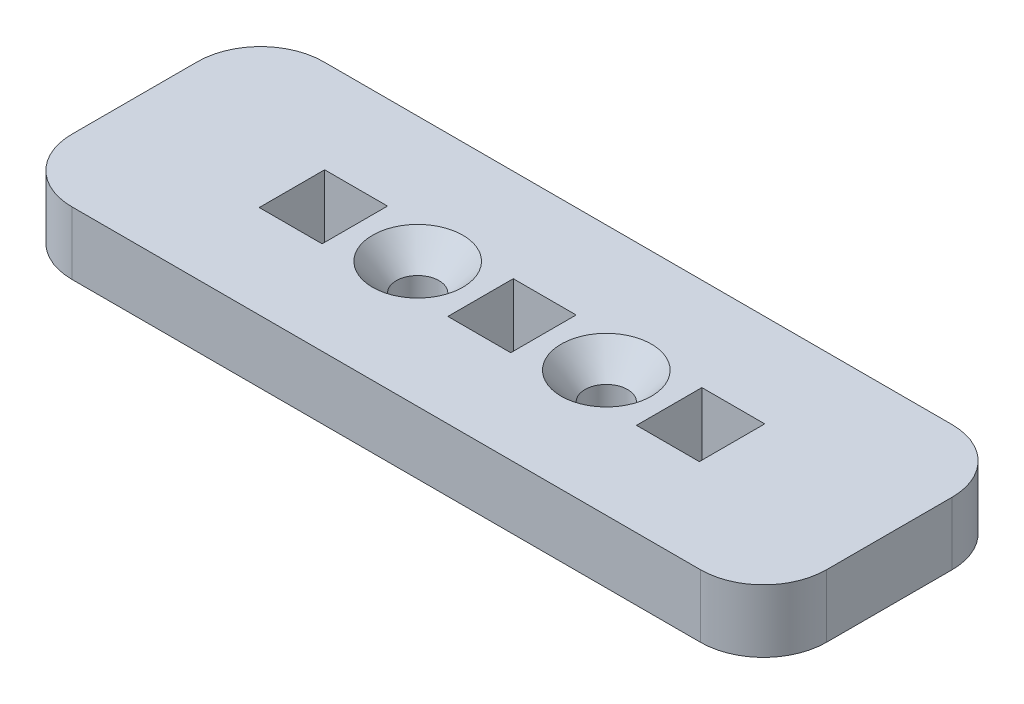
ISO-10303-21;
HEADER;
FILE_DESCRIPTION(('STEP AP214'),'2;1');
FILE_NAME('part.step','',(''),(''),'','','');
FILE_SCHEMA(('AUTOMOTIVE_DESIGN { 1 0 10303 214 1 1 1 1 }'));
ENDSEC;
DATA;
#1=APPLICATION_CONTEXT('core data for automotive mechanical design processes');
#2=APPLICATION_PROTOCOL_DEFINITION('international standard','automotive_design',2000,#1);
#3=PRODUCT_CONTEXT('',#1,'mechanical');
#4=PRODUCT('Part','Part','',(#3));
#5=PRODUCT_RELATED_PRODUCT_CATEGORY('part','',(#4));
#6=PRODUCT_DEFINITION_FORMATION('','',#4);
#7=PRODUCT_DEFINITION_CONTEXT('part definition',#1,'design');
#8=PRODUCT_DEFINITION('design','',#6,#7);
#9=PRODUCT_DEFINITION_SHAPE('','',#8);
#10=(LENGTH_UNIT() NAMED_UNIT(*) SI_UNIT(.MILLI.,.METRE.));
#11=(NAMED_UNIT(*) PLANE_ANGLE_UNIT() SI_UNIT($,.RADIAN.));
#12=(NAMED_UNIT(*) SI_UNIT($,.STERADIAN.) SOLID_ANGLE_UNIT());
#13=UNCERTAINTY_MEASURE_WITH_UNIT(LENGTH_MEASURE(1.E-05),#10,'distance_accuracy_value','');
#14=(GEOMETRIC_REPRESENTATION_CONTEXT(3) GLOBAL_UNCERTAINTY_ASSIGNED_CONTEXT((#13)) GLOBAL_UNIT_ASSIGNED_CONTEXT((#10,
#11,#12)) REPRESENTATION_CONTEXT('',''));
#15=CARTESIAN_POINT('',(0.,0.,0.));
#16=DIRECTION('',(0.,0.,1.));
#17=DIRECTION('',(1.,0.,0.));
#18=AXIS2_PLACEMENT_3D('',#15,#16,#17);
#19=CARTESIAN_POINT('',(-38.1,6.35,-12.7));
#20=DIRECTION('',(1.,0.,0.));
#21=DIRECTION('',(0.,0.,-1.));
#22=AXIS2_PLACEMENT_3D('',#19,#20,#21);
#23=PLANE('',#22);
#24=DIRECTION('',(0.,0.,1.));
#25=VECTOR('',#24,1.);
#26=CARTESIAN_POINT('',(-38.1,0.,-12.7));
#27=LINE('',#26,#25);
#28=CARTESIAN_POINT('',(-38.1,0.,-6.35));
#29=VERTEX_POINT('',#28);
#30=CARTESIAN_POINT('',(-38.1,0.,6.35));
#31=VERTEX_POINT('',#30);
#32=EDGE_CURVE('E281',#29,#31,#27,.T.);
#33=ORIENTED_EDGE('',*,*,#32,.T.);
#34=DIRECTION('',(0.,-1.,0.));
#35=VECTOR('',#34,1.);
#36=CARTESIAN_POINT('',(-38.1,6.35,6.35));
#37=LINE('',#36,#35);
#38=CARTESIAN_POINT('',(-38.1,6.35,6.35));
#39=VERTEX_POINT('',#38);
#40=EDGE_CURVE('E325',#31,#39,#37,.F.);
#41=ORIENTED_EDGE('',*,*,#40,.T.);
#42=DIRECTION('',(0.,0.,1.));
#43=VECTOR('',#42,1.);
#44=CARTESIAN_POINT('',(-38.1,6.35,-12.7));
#45=LINE('',#44,#43);
#46=CARTESIAN_POINT('',(-38.1,6.35,-6.35));
#47=VERTEX_POINT('',#46);
#48=EDGE_CURVE('E288',#47,#39,#45,.T.);
#49=ORIENTED_EDGE('',*,*,#48,.F.);
#50=DIRECTION('',(0.,-1.,0.));
#51=VECTOR('',#50,1.);
#52=CARTESIAN_POINT('',(-38.1,6.35,-6.35));
#53=LINE('',#52,#51);
#54=EDGE_CURVE('E322',#47,#29,#53,.T.);
#55=ORIENTED_EDGE('',*,*,#54,.T.);
#56=EDGE_LOOP('',(#33,#41,#49,#55));
#57=FACE_BOUND('',#56,.T.);
#58=ADVANCED_FACE('F37',(#57),#23,.F.);
#59=CARTESIAN_POINT('',(-38.1,6.35,12.7));
#60=DIRECTION('',(0.,0.,-1.));
#61=DIRECTION('',(-1.,0.,0.));
#62=AXIS2_PLACEMENT_3D('',#59,#60,#61);
#63=PLANE('',#62);
#64=DIRECTION('',(1.,0.,0.));
#65=VECTOR('',#64,1.);
#66=CARTESIAN_POINT('',(-38.1,6.35,12.7));
#67=LINE('',#66,#65);
#68=CARTESIAN_POINT('',(-31.75,6.35,12.7));
#69=VERTEX_POINT('',#68);
#70=CARTESIAN_POINT('',(31.75,6.35,12.7));
#71=VERTEX_POINT('',#70);
#72=EDGE_CURVE('E291',#69,#71,#67,.T.);
#73=ORIENTED_EDGE('',*,*,#72,.F.);
#74=DIRECTION('',(0.,-1.,0.));
#75=VECTOR('',#74,1.);
#76=CARTESIAN_POINT('',(-31.75,6.35,12.7));
#77=LINE('',#76,#75);
#78=CARTESIAN_POINT('',(-31.75,0.,12.7));
#79=VERTEX_POINT('',#78);
#80=EDGE_CURVE('E311',#69,#79,#77,.T.);
#81=ORIENTED_EDGE('',*,*,#80,.T.);
#82=DIRECTION('',(1.,0.,0.));
#83=VECTOR('',#82,1.);
#84=CARTESIAN_POINT('',(-38.1,0.,12.7));
#85=LINE('',#84,#83);
#86=CARTESIAN_POINT('',(31.75,0.,12.7));
#87=VERTEX_POINT('',#86);
#88=EDGE_CURVE('E302',#79,#87,#85,.T.);
#89=ORIENTED_EDGE('',*,*,#88,.T.);
#90=DIRECTION('',(0.,-1.,0.));
#91=VECTOR('',#90,1.);
#92=CARTESIAN_POINT('',(31.75,6.35,12.7));
#93=LINE('',#92,#91);
#94=EDGE_CURVE('E299',#87,#71,#93,.F.);
#95=ORIENTED_EDGE('',*,*,#94,.T.);
#96=EDGE_LOOP('',(#73,#81,#89,#95));
#97=FACE_BOUND('',#96,.T.);
#98=ADVANCED_FACE('F361',(#97),#63,.F.);
#99=CARTESIAN_POINT('',(38.1,6.35,-12.7));
#100=DIRECTION('',(-1.,0.,0.));
#101=DIRECTION('',(0.,0.,1.));
#102=AXIS2_PLACEMENT_3D('',#99,#100,#101);
#103=PLANE('',#102);
#104=DIRECTION('',(0.,0.,-1.));
#105=VECTOR('',#104,1.);
#106=CARTESIAN_POINT('',(38.1,6.35,-12.7));
#107=LINE('',#106,#105);
#108=CARTESIAN_POINT('',(38.1,6.35,6.35));
#109=VERTEX_POINT('',#108);
#110=CARTESIAN_POINT('',(38.1,6.35,-6.35));
#111=VERTEX_POINT('',#110);
#112=EDGE_CURVE('E295',#109,#111,#107,.T.);
#113=ORIENTED_EDGE('',*,*,#112,.F.);
#114=DIRECTION('',(0.,-1.,0.));
#115=VECTOR('',#114,1.);
#116=CARTESIAN_POINT('',(38.1,6.35,6.35));
#117=LINE('',#116,#115);
#118=CARTESIAN_POINT('',(38.1,0.,6.35));
#119=VERTEX_POINT('',#118);
#120=EDGE_CURVE('E336',#109,#119,#117,.T.);
#121=ORIENTED_EDGE('',*,*,#120,.T.);
#122=DIRECTION('',(0.,0.,-1.));
#123=VECTOR('',#122,1.);
#124=CARTESIAN_POINT('',(38.1,0.,-12.7));
#125=LINE('',#124,#123);
#126=CARTESIAN_POINT('',(38.1,0.,-6.35));
#127=VERTEX_POINT('',#126);
#128=EDGE_CURVE('E306',#119,#127,#125,.T.);
#129=ORIENTED_EDGE('',*,*,#128,.T.);
#130=DIRECTION('',(0.,-1.,0.));
#131=VECTOR('',#130,1.);
#132=CARTESIAN_POINT('',(38.1,6.35,-6.35));
#133=LINE('',#132,#131);
#134=EDGE_CURVE('E334',#127,#111,#133,.F.);
#135=ORIENTED_EDGE('',*,*,#134,.T.);
#136=EDGE_LOOP('',(#113,#121,#129,#135));
#137=FACE_BOUND('',#136,.T.);
#138=ADVANCED_FACE('F369',(#137),#103,.F.);
#139=CARTESIAN_POINT('',(-38.1,6.35,-12.7));
#140=DIRECTION('',(0.,0.,1.));
#141=DIRECTION('',(1.,0.,0.));
#142=AXIS2_PLACEMENT_3D('',#139,#140,#141);
#143=PLANE('',#142);
#144=DIRECTION('',(-1.,0.,0.));
#145=VECTOR('',#144,1.);
#146=CARTESIAN_POINT('',(-38.1,0.,-12.7));
#147=LINE('',#146,#145);
#148=CARTESIAN_POINT('',(31.75,0.,-12.7));
#149=VERTEX_POINT('',#148);
#150=CARTESIAN_POINT('',(-31.75,0.,-12.7));
#151=VERTEX_POINT('',#150);
#152=EDGE_CURVE('E292',#149,#151,#147,.T.);
#153=ORIENTED_EDGE('',*,*,#152,.T.);
#154=DIRECTION('',(0.,-1.,0.));
#155=VECTOR('',#154,1.);
#156=CARTESIAN_POINT('',(-31.75,6.35,-12.7));
#157=LINE('',#156,#155);
#158=CARTESIAN_POINT('',(-31.75,6.35,-12.7));
#159=VERTEX_POINT('',#158);
#160=EDGE_CURVE('E11',#151,#159,#157,.F.);
#161=ORIENTED_EDGE('',*,*,#160,.T.);
#162=DIRECTION('',(-1.,0.,0.));
#163=VECTOR('',#162,1.);
#164=CARTESIAN_POINT('',(-38.1,6.35,-12.7));
#165=LINE('',#164,#163);
#166=CARTESIAN_POINT('',(31.75,6.35,-12.7));
#167=VERTEX_POINT('',#166);
#168=EDGE_CURVE('E297',#167,#159,#165,.T.);
#169=ORIENTED_EDGE('',*,*,#168,.F.);
#170=DIRECTION('',(0.,-1.,0.));
#171=VECTOR('',#170,1.);
#172=CARTESIAN_POINT('',(31.75,6.35,-12.7));
#173=LINE('',#172,#171);
#174=EDGE_CURVE('E45',#167,#149,#173,.T.);
#175=ORIENTED_EDGE('',*,*,#174,.T.);
#176=EDGE_LOOP('',(#153,#161,#169,#175));
#177=FACE_BOUND('',#176,.T.);
#178=ADVANCED_FACE('F341',(#177),#143,.F.);
#179=CARTESIAN_POINT('',(0.,6.35,0.));
#180=DIRECTION('',(0.,1.,0.));
#181=DIRECTION('',(0.,0.,1.));
#182=AXIS2_PLACEMENT_3D('',#179,#180,#181);
#183=PLANE('',#182);
#184=CARTESIAN_POINT('',(-9.52499999999993,6.35,0.));
#185=DIRECTION('',(0.,1.,0.));
#186=DIRECTION('',(0.,0.,1.));
#187=AXIS2_PLACEMENT_3D('',#184,#185,#186);
#188=CIRCLE('',#187,4.5593);
#189=CARTESIAN_POINT('',(-9.52499999999993,6.35,4.55929999999999));
#190=VERTEX_POINT('',#189);
#191=EDGE_CURVE('E625',#190,#190,#188,.T.);
#192=ORIENTED_EDGE('',*,*,#191,.F.);
#193=EDGE_LOOP('',(#192));
#194=FACE_BOUND('',#193,.T.);
#195=CARTESIAN_POINT('',(9.52499999999966,6.35,0.));
#196=DIRECTION('',(0.,1.,0.));
#197=DIRECTION('',(0.,0.,1.));
#198=AXIS2_PLACEMENT_3D('',#195,#196,#197);
#199=CIRCLE('',#198,4.5593);
#200=CARTESIAN_POINT('',(9.52499999999966,6.35,4.55930000000002));
#201=VERTEX_POINT('',#200);
#202=EDGE_CURVE('E616',#201,#201,#199,.T.);
#203=ORIENTED_EDGE('',*,*,#202,.F.);
#204=EDGE_LOOP('',(#203));
#205=FACE_BOUND('',#204,.T.);
#206=DIRECTION('',(0.,0.,1.));
#207=VECTOR('',#206,1.);
#208=CARTESIAN_POINT('',(15.8749999999995,6.35,-3.30199999999998));
#209=LINE('',#208,#207);
#210=CARTESIAN_POINT('',(15.8749999999995,6.35,-3.30199999999998));
#211=VERTEX_POINT('',#210);
#212=CARTESIAN_POINT('',(15.8749999999995,6.35,3.30200000000001));
#213=VERTEX_POINT('',#212);
#214=EDGE_CURVE('E181',#211,#213,#209,.T.);
#215=ORIENTED_EDGE('',*,*,#214,.F.);
#216=DIRECTION('',(-1.,0.,0.));
#217=VECTOR('',#216,1.);
#218=CARTESIAN_POINT('',(15.8749999999995,6.35,-3.30199999999998));
#219=LINE('',#218,#217);
#220=CARTESIAN_POINT('',(22.2249999999995,6.35,-3.30199999999998));
#221=VERTEX_POINT('',#220);
#222=EDGE_CURVE('E199',#221,#211,#219,.T.);
#223=ORIENTED_EDGE('',*,*,#222,.F.);
#224=DIRECTION('',(0.,0.,-1.));
#225=VECTOR('',#224,1.);
#226=CARTESIAN_POINT('',(22.2249999999995,6.35,-3.30199999999998));
#227=LINE('',#226,#225);
#228=CARTESIAN_POINT('',(22.2249999999995,6.35,3.30200000000001));
#229=VERTEX_POINT('',#228);
#230=EDGE_CURVE('E202',#229,#221,#227,.T.);
#231=ORIENTED_EDGE('',*,*,#230,.F.);
#232=DIRECTION('',(1.,0.,0.));
#233=VECTOR('',#232,1.);
#234=CARTESIAN_POINT('',(15.8749999999995,6.35,3.30200000000001));
#235=LINE('',#234,#233);
#236=EDGE_CURVE('E211',#213,#229,#235,.T.);
#237=ORIENTED_EDGE('',*,*,#236,.F.);
#238=EDGE_LOOP('',(#215,#223,#231,#237));
#239=FACE_BOUND('',#238,.T.);
#240=DIRECTION('',(0.,0.,1.));
#241=VECTOR('',#240,1.);
#242=CARTESIAN_POINT('',(-22.2249999999999,6.35,3.30200000000002));
#243=LINE('',#242,#241);
#244=CARTESIAN_POINT('',(-22.2249999999998,6.35,-3.30199999999998));
#245=VERTEX_POINT('',#244);
#246=CARTESIAN_POINT('',(-22.2249999999999,6.35,3.30200000000002));
#247=VERTEX_POINT('',#246);
#248=EDGE_CURVE('E223',#245,#247,#243,.T.);
#249=ORIENTED_EDGE('',*,*,#248,.F.);
#250=DIRECTION('',(-1.,0.,0.));
#251=VECTOR('',#250,1.);
#252=CARTESIAN_POINT('',(-22.2249999999998,6.35,-3.30199999999998));
#253=LINE('',#252,#251);
#254=CARTESIAN_POINT('',(-15.8749999999998,6.35,-3.30199999999998));
#255=VERTEX_POINT('',#254);
#256=EDGE_CURVE('E228',#255,#245,#253,.T.);
#257=ORIENTED_EDGE('',*,*,#256,.F.);
#258=DIRECTION('',(0.,0.,-1.));
#259=VECTOR('',#258,1.);
#260=CARTESIAN_POINT('',(-15.8749999999998,6.35,-3.30199999999998));
#261=LINE('',#260,#259);
#262=CARTESIAN_POINT('',(-15.875,6.35,3.30199999999999));
#263=VERTEX_POINT('',#262);
#264=EDGE_CURVE('E242',#263,#255,#261,.T.);
#265=ORIENTED_EDGE('',*,*,#264,.F.);
#266=DIRECTION('',(1.,0.,0.));
#267=VECTOR('',#266,1.);
#268=CARTESIAN_POINT('',(-15.875,6.35,3.30199999999999));
#269=LINE('',#268,#267);
#270=EDGE_CURVE('E239',#247,#263,#269,.T.);
#271=ORIENTED_EDGE('',*,*,#270,.F.);
#272=EDGE_LOOP('',(#249,#257,#265,#271));
#273=FACE_BOUND('',#272,.T.);
#274=DIRECTION('',(0.,0.,1.));
#275=VECTOR('',#274,1.);
#276=CARTESIAN_POINT('',(-3.17499999999991,6.35,3.30200000000001));
#277=LINE('',#276,#275);
#278=CARTESIAN_POINT('',(-3.17500000000007,6.35,-3.30199999999999));
#279=VERTEX_POINT('',#278);
#280=CARTESIAN_POINT('',(-3.17499999999991,6.35,3.30200000000001));
#281=VERTEX_POINT('',#280);
#282=EDGE_CURVE('E249',#279,#281,#277,.T.);
#283=ORIENTED_EDGE('',*,*,#282,.F.);
#284=DIRECTION('',(-1.,0.,0.));
#285=VECTOR('',#284,1.);
#286=CARTESIAN_POINT('',(-3.17500000000007,6.35,-3.30199999999999));
#287=LINE('',#286,#285);
#288=CARTESIAN_POINT('',(3.17500000000009,6.35,-3.302));
#289=VERTEX_POINT('',#288);
#290=EDGE_CURVE('E260',#289,#279,#287,.T.);
#291=ORIENTED_EDGE('',*,*,#290,.F.);
#292=DIRECTION('',(0.,0.,-1.));
#293=VECTOR('',#292,1.);
#294=CARTESIAN_POINT('',(3.17500000000009,6.35,-3.302));
#295=LINE('',#294,#293);
#296=CARTESIAN_POINT('',(3.17500000000006,6.35,3.30199999999999));
#297=VERTEX_POINT('',#296);
#298=EDGE_CURVE('E274',#297,#289,#295,.T.);
#299=ORIENTED_EDGE('',*,*,#298,.F.);
#300=DIRECTION('',(1.,0.,0.));
#301=VECTOR('',#300,1.);
#302=CARTESIAN_POINT('',(3.17500000000006,6.35,3.30199999999999));
#303=LINE('',#302,#301);
#304=EDGE_CURVE('E271',#281,#297,#303,.T.);
#305=ORIENTED_EDGE('',*,*,#304,.F.);
#306=EDGE_LOOP('',(#283,#291,#299,#305));
#307=FACE_BOUND('',#306,.T.);
#308=ORIENTED_EDGE('',*,*,#48,.T.);
#309=CARTESIAN_POINT('',(-31.75,6.35,6.35));
#310=DIRECTION('',(0.,1.,0.));
#311=DIRECTION('',(0.,0.,1.));
#312=AXIS2_PLACEMENT_3D('',#309,#310,#311);
#313=CIRCLE('',#312,6.35);
#314=EDGE_CURVE('E332',#39,#69,#313,.T.);
#315=ORIENTED_EDGE('',*,*,#314,.T.);
#316=ORIENTED_EDGE('',*,*,#72,.T.);
#317=CARTESIAN_POINT('',(31.75,6.35,6.35));
#318=DIRECTION('',(0.,1.,0.));
#319=DIRECTION('',(0.,0.,1.));
#320=AXIS2_PLACEMENT_3D('',#317,#318,#319);
#321=CIRCLE('',#320,6.35);
#322=EDGE_CURVE('E330',#71,#109,#321,.T.);
#323=ORIENTED_EDGE('',*,*,#322,.T.);
#324=ORIENTED_EDGE('',*,*,#112,.T.);
#325=CARTESIAN_POINT('',(31.75,6.35,-6.35));
#326=DIRECTION('',(0.,1.,0.));
#327=DIRECTION('',(0.,0.,1.));
#328=AXIS2_PLACEMENT_3D('',#325,#326,#327);
#329=CIRCLE('',#328,6.35);
#330=EDGE_CURVE('E57',#111,#167,#329,.T.);
#331=ORIENTED_EDGE('',*,*,#330,.T.);
#332=ORIENTED_EDGE('',*,*,#168,.T.);
#333=CARTESIAN_POINT('',(-31.75,6.35,-6.35));
#334=DIRECTION('',(0.,1.,0.));
#335=DIRECTION('',(0.,0.,1.));
#336=AXIS2_PLACEMENT_3D('',#333,#334,#335);
#337=CIRCLE('',#336,6.35);
#338=EDGE_CURVE('E328',#159,#47,#337,.T.);
#339=ORIENTED_EDGE('',*,*,#338,.T.);
#340=EDGE_LOOP('',(#308,#315,#316,#323,#324,#331,#332,#339));
#341=FACE_BOUND('',#340,.T.);
#342=ADVANCED_FACE('F355',(#194,#205,#239,#273,#307,#341),#183,.T.);
#343=CARTESIAN_POINT('',(0.,0.,0.));
#344=DIRECTION('',(0.,1.,0.));
#345=DIRECTION('',(0.,0.,1.));
#346=AXIS2_PLACEMENT_3D('',#343,#344,#345);
#347=PLANE('',#346);
#348=CARTESIAN_POINT('',(9.52499999999966,0.,0.));
#349=DIRECTION('',(0.,1.,0.));
#350=DIRECTION('',(0.,0.,1.));
#351=AXIS2_PLACEMENT_3D('',#348,#349,#350);
#352=CIRCLE('',#351,2.15265);
#353=CARTESIAN_POINT('',(9.52499999999966,0.,2.15265000000002));
#354=VERTEX_POINT('',#353);
#355=EDGE_CURVE('E205',#354,#354,#352,.T.);
#356=ORIENTED_EDGE('',*,*,#355,.T.);
#357=EDGE_LOOP('',(#356));
#358=FACE_BOUND('',#357,.T.);
#359=DIRECTION('',(-1.,0.,0.));
#360=VECTOR('',#359,1.);
#361=CARTESIAN_POINT('',(15.8749999999995,0.,-3.30199999999998));
#362=LINE('',#361,#360);
#363=CARTESIAN_POINT('',(22.2249999999995,0.,-3.30199999999998));
#364=VERTEX_POINT('',#363);
#365=CARTESIAN_POINT('',(15.8749999999995,0.,-3.30199999999998));
#366=VERTEX_POINT('',#365);
#367=EDGE_CURVE('E186',#364,#366,#362,.T.);
#368=ORIENTED_EDGE('',*,*,#367,.T.);
#369=DIRECTION('',(0.,0.,1.));
#370=VECTOR('',#369,1.);
#371=CARTESIAN_POINT('',(15.8749999999995,0.,-3.30199999999998));
#372=LINE('',#371,#370);
#373=CARTESIAN_POINT('',(15.8749999999995,0.,3.30200000000001));
#374=VERTEX_POINT('',#373);
#375=EDGE_CURVE('E178',#366,#374,#372,.T.);
#376=ORIENTED_EDGE('',*,*,#375,.T.);
#377=DIRECTION('',(1.,0.,0.));
#378=VECTOR('',#377,1.);
#379=CARTESIAN_POINT('',(15.8749999999995,0.,3.30200000000001));
#380=LINE('',#379,#378);
#381=CARTESIAN_POINT('',(22.2249999999995,0.,3.30200000000001));
#382=VERTEX_POINT('',#381);
#383=EDGE_CURVE('E190',#374,#382,#380,.T.);
#384=ORIENTED_EDGE('',*,*,#383,.T.);
#385=DIRECTION('',(0.,0.,-1.));
#386=VECTOR('',#385,1.);
#387=CARTESIAN_POINT('',(22.2249999999995,0.,-3.30199999999998));
#388=LINE('',#387,#386);
#389=EDGE_CURVE('E194',#382,#364,#388,.T.);
#390=ORIENTED_EDGE('',*,*,#389,.T.);
#391=EDGE_LOOP('',(#368,#376,#384,#390));
#392=FACE_BOUND('',#391,.T.);
#393=CARTESIAN_POINT('',(-9.52499999999993,0.,0.));
#394=DIRECTION('',(0.,1.,0.));
#395=DIRECTION('',(0.,0.,1.));
#396=AXIS2_PLACEMENT_3D('',#393,#394,#395);
#397=CIRCLE('',#396,2.15265);
#398=CARTESIAN_POINT('',(-9.52499999999993,0.,2.15264999999999));
#399=VERTEX_POINT('',#398);
#400=EDGE_CURVE('E217',#399,#399,#397,.T.);
#401=ORIENTED_EDGE('',*,*,#400,.T.);
#402=EDGE_LOOP('',(#401));
#403=FACE_BOUND('',#402,.T.);
#404=DIRECTION('',(-1.,0.,0.));
#405=VECTOR('',#404,1.);
#406=CARTESIAN_POINT('',(-22.2249999999998,0.,-3.30199999999998));
#407=LINE('',#406,#405);
#408=CARTESIAN_POINT('',(-15.8749999999998,0.,-3.30199999999998));
#409=VERTEX_POINT('',#408);
#410=CARTESIAN_POINT('',(-22.2249999999998,0.,-3.30199999999998));
#411=VERTEX_POINT('',#410);
#412=EDGE_CURVE('E234',#409,#411,#407,.T.);
#413=ORIENTED_EDGE('',*,*,#412,.T.);
#414=DIRECTION('',(0.,0.,1.));
#415=VECTOR('',#414,1.);
#416=CARTESIAN_POINT('',(-22.2249999999999,0.,3.30200000000002));
#417=LINE('',#416,#415);
#418=CARTESIAN_POINT('',(-22.2249999999999,0.,3.30200000000002));
#419=VERTEX_POINT('',#418);
#420=EDGE_CURVE('E224',#411,#419,#417,.T.);
#421=ORIENTED_EDGE('',*,*,#420,.T.);
#422=DIRECTION('',(1.,0.,0.));
#423=VECTOR('',#422,1.);
#424=CARTESIAN_POINT('',(-15.875,0.,3.30199999999999));
#425=LINE('',#424,#423);
#426=CARTESIAN_POINT('',(-15.875,0.,3.30199999999999));
#427=VERTEX_POINT('',#426);
#428=EDGE_CURVE('E227',#419,#427,#425,.T.);
#429=ORIENTED_EDGE('',*,*,#428,.T.);
#430=DIRECTION('',(0.,0.,-1.));
#431=VECTOR('',#430,1.);
#432=CARTESIAN_POINT('',(-15.8749999999998,0.,-3.30199999999998));
#433=LINE('',#432,#431);
#434=EDGE_CURVE('E231',#427,#409,#433,.T.);
#435=ORIENTED_EDGE('',*,*,#434,.T.);
#436=EDGE_LOOP('',(#413,#421,#429,#435));
#437=FACE_BOUND('',#436,.T.);
#438=DIRECTION('',(-1.,0.,0.));
#439=VECTOR('',#438,1.);
#440=CARTESIAN_POINT('',(-3.17500000000007,0.,-3.30199999999999));
#441=LINE('',#440,#439);
#442=CARTESIAN_POINT('',(3.17500000000009,0.,-3.302));
#443=VERTEX_POINT('',#442);
#444=CARTESIAN_POINT('',(-3.17500000000007,0.,-3.30199999999999));
#445=VERTEX_POINT('',#444);
#446=EDGE_CURVE('E266',#443,#445,#441,.T.);
#447=ORIENTED_EDGE('',*,*,#446,.T.);
#448=DIRECTION('',(0.,0.,1.));
#449=VECTOR('',#448,1.);
#450=CARTESIAN_POINT('',(-3.17499999999991,0.,3.30200000000001));
#451=LINE('',#450,#449);
#452=CARTESIAN_POINT('',(-3.17499999999991,0.,3.30200000000001));
#453=VERTEX_POINT('',#452);
#454=EDGE_CURVE('E256',#445,#453,#451,.T.);
#455=ORIENTED_EDGE('',*,*,#454,.T.);
#456=DIRECTION('',(1.,0.,0.));
#457=VECTOR('',#456,1.);
#458=CARTESIAN_POINT('',(3.17500000000006,0.,3.30199999999999));
#459=LINE('',#458,#457);
#460=CARTESIAN_POINT('',(3.17500000000006,0.,3.30199999999999));
#461=VERTEX_POINT('',#460);
#462=EDGE_CURVE('E259',#453,#461,#459,.T.);
#463=ORIENTED_EDGE('',*,*,#462,.T.);
#464=DIRECTION('',(0.,0.,-1.));
#465=VECTOR('',#464,1.);
#466=CARTESIAN_POINT('',(3.17500000000009,0.,-3.302));
#467=LINE('',#466,#465);
#468=EDGE_CURVE('E263',#461,#443,#467,.T.);
#469=ORIENTED_EDGE('',*,*,#468,.T.);
#470=EDGE_LOOP('',(#447,#455,#463,#469));
#471=FACE_BOUND('',#470,.T.);
#472=ORIENTED_EDGE('',*,*,#88,.F.);
#473=CARTESIAN_POINT('',(-31.75,0.,6.35));
#474=DIRECTION('',(0.,1.,0.));
#475=DIRECTION('',(0.,0.,1.));
#476=AXIS2_PLACEMENT_3D('',#473,#474,#475);
#477=CIRCLE('',#476,6.35);
#478=EDGE_CURVE('E320',#79,#31,#477,.F.);
#479=ORIENTED_EDGE('',*,*,#478,.T.);
#480=ORIENTED_EDGE('',*,*,#32,.F.);
#481=CARTESIAN_POINT('',(-31.75,0.,-6.35));
#482=DIRECTION('',(0.,1.,0.));
#483=DIRECTION('',(0.,0.,1.));
#484=AXIS2_PLACEMENT_3D('',#481,#482,#483);
#485=CIRCLE('',#484,6.35);
#486=EDGE_CURVE('E316',#29,#151,#485,.F.);
#487=ORIENTED_EDGE('',*,*,#486,.T.);
#488=ORIENTED_EDGE('',*,*,#152,.F.);
#489=CARTESIAN_POINT('',(31.75,0.,-6.35));
#490=DIRECTION('',(0.,1.,0.));
#491=DIRECTION('',(0.,0.,1.));
#492=AXIS2_PLACEMENT_3D('',#489,#490,#491);
#493=CIRCLE('',#492,6.35);
#494=EDGE_CURVE('E314',#149,#127,#493,.F.);
#495=ORIENTED_EDGE('',*,*,#494,.T.);
#496=ORIENTED_EDGE('',*,*,#128,.F.);
#497=CARTESIAN_POINT('',(31.75,0.,6.35));
#498=DIRECTION('',(0.,1.,0.));
#499=DIRECTION('',(0.,0.,1.));
#500=AXIS2_PLACEMENT_3D('',#497,#498,#499);
#501=CIRCLE('',#500,6.35);
#502=EDGE_CURVE('E318',#119,#87,#501,.F.);
#503=ORIENTED_EDGE('',*,*,#502,.T.);
#504=EDGE_LOOP('',(#472,#479,#480,#487,#488,#495,#496,#503));
#505=FACE_BOUND('',#504,.T.);
#506=ADVANCED_FACE('F196',(#358,#392,#403,#437,#471,#505),#347,.F.);
#507=CARTESIAN_POINT('',(-3.17499999999991,0.,3.30200000000001));
#508=DIRECTION('',(-1.,0.,0.));
#509=DIRECTION('',(0.,0.,1.));
#510=AXIS2_PLACEMENT_3D('',#507,#508,#509);
#511=PLANE('',#510);
#512=ORIENTED_EDGE('',*,*,#282,.T.);
#513=DIRECTION('',(0.,1.,0.));
#514=VECTOR('',#513,1.);
#515=CARTESIAN_POINT('',(-3.17499999999991,0.,3.30200000000001));
#516=LINE('',#515,#514);
#517=EDGE_CURVE('E269',#453,#281,#516,.T.);
#518=ORIENTED_EDGE('',*,*,#517,.F.);
#519=ORIENTED_EDGE('',*,*,#454,.F.);
#520=DIRECTION('',(0.,1.,0.));
#521=VECTOR('',#520,1.);
#522=CARTESIAN_POINT('',(-3.17500000000007,0.,-3.30199999999999));
#523=LINE('',#522,#521);
#524=EDGE_CURVE('E279',#445,#279,#523,.T.);
#525=ORIENTED_EDGE('',*,*,#524,.T.);
#526=EDGE_LOOP('',(#512,#518,#519,#525));
#527=FACE_BOUND('',#526,.T.);
#528=ADVANCED_FACE('F485',(#527),#511,.F.);
#529=CARTESIAN_POINT('',(-3.17500000000007,0.,-3.30199999999999));
#530=DIRECTION('',(0.,0.,-1.));
#531=DIRECTION('',(-1.,0.,0.));
#532=AXIS2_PLACEMENT_3D('',#529,#530,#531);
#533=PLANE('',#532);
#534=ORIENTED_EDGE('',*,*,#290,.T.);
#535=ORIENTED_EDGE('',*,*,#524,.F.);
#536=ORIENTED_EDGE('',*,*,#446,.F.);
#537=DIRECTION('',(0.,1.,0.));
#538=VECTOR('',#537,1.);
#539=CARTESIAN_POINT('',(3.17500000000009,0.,-3.302));
#540=LINE('',#539,#538);
#541=EDGE_CURVE('E282',#443,#289,#540,.T.);
#542=ORIENTED_EDGE('',*,*,#541,.T.);
#543=EDGE_LOOP('',(#534,#535,#536,#542));
#544=FACE_BOUND('',#543,.T.);
#545=ADVANCED_FACE('F481',(#544),#533,.F.);
#546=CARTESIAN_POINT('',(3.17500000000009,0.,-3.302));
#547=DIRECTION('',(1.,0.,0.));
#548=DIRECTION('',(0.,0.,-1.));
#549=AXIS2_PLACEMENT_3D('',#546,#547,#548);
#550=PLANE('',#549);
#551=ORIENTED_EDGE('',*,*,#298,.T.);
#552=ORIENTED_EDGE('',*,*,#541,.F.);
#553=ORIENTED_EDGE('',*,*,#468,.F.);
#554=DIRECTION('',(0.,1.,0.));
#555=VECTOR('',#554,1.);
#556=CARTESIAN_POINT('',(3.17500000000006,0.,3.30199999999999));
#557=LINE('',#556,#555);
#558=EDGE_CURVE('E284',#461,#297,#557,.T.);
#559=ORIENTED_EDGE('',*,*,#558,.T.);
#560=EDGE_LOOP('',(#551,#552,#553,#559));
#561=FACE_BOUND('',#560,.T.);
#562=ADVANCED_FACE('F484',(#561),#550,.F.);
#563=CARTESIAN_POINT('',(3.17500000000006,0.,3.30199999999999));
#564=DIRECTION('',(0.,0.,1.));
#565=DIRECTION('',(1.,0.,0.));
#566=AXIS2_PLACEMENT_3D('',#563,#564,#565);
#567=PLANE('',#566);
#568=ORIENTED_EDGE('',*,*,#304,.T.);
#569=ORIENTED_EDGE('',*,*,#558,.F.);
#570=ORIENTED_EDGE('',*,*,#462,.F.);
#571=ORIENTED_EDGE('',*,*,#517,.T.);
#572=EDGE_LOOP('',(#568,#569,#570,#571));
#573=FACE_BOUND('',#572,.T.);
#574=ADVANCED_FACE('F479',(#573),#567,.F.);
#575=CARTESIAN_POINT('',(-22.2249999999999,0.,3.30200000000002));
#576=DIRECTION('',(-1.,0.,0.));
#577=DIRECTION('',(0.,0.,1.));
#578=AXIS2_PLACEMENT_3D('',#575,#576,#577);
#579=PLANE('',#578);
#580=ORIENTED_EDGE('',*,*,#248,.T.);
#581=DIRECTION('',(0.,1.,0.));
#582=VECTOR('',#581,1.);
#583=CARTESIAN_POINT('',(-22.2249999999999,0.,3.30200000000002));
#584=LINE('',#583,#582);
#585=EDGE_CURVE('E237',#419,#247,#584,.T.);
#586=ORIENTED_EDGE('',*,*,#585,.F.);
#587=ORIENTED_EDGE('',*,*,#420,.F.);
#588=DIRECTION('',(0.,1.,0.));
#589=VECTOR('',#588,1.);
#590=CARTESIAN_POINT('',(-22.2249999999998,0.,-3.30199999999998));
#591=LINE('',#590,#589);
#592=EDGE_CURVE('E247',#411,#245,#591,.T.);
#593=ORIENTED_EDGE('',*,*,#592,.T.);
#594=EDGE_LOOP('',(#580,#586,#587,#593));
#595=FACE_BOUND('',#594,.T.);
#596=ADVANCED_FACE('F470',(#595),#579,.F.);
#597=CARTESIAN_POINT('',(-22.2249999999998,0.,-3.30199999999998));
#598=DIRECTION('',(0.,0.,-1.));
#599=DIRECTION('',(-1.,0.,0.));
#600=AXIS2_PLACEMENT_3D('',#597,#598,#599);
#601=PLANE('',#600);
#602=ORIENTED_EDGE('',*,*,#256,.T.);
#603=ORIENTED_EDGE('',*,*,#592,.F.);
#604=ORIENTED_EDGE('',*,*,#412,.F.);
#605=DIRECTION('',(0.,1.,0.));
#606=VECTOR('',#605,1.);
#607=CARTESIAN_POINT('',(-15.8749999999998,0.,-3.30199999999998));
#608=LINE('',#607,#606);
#609=EDGE_CURVE('E250',#409,#255,#608,.T.);
#610=ORIENTED_EDGE('',*,*,#609,.T.);
#611=EDGE_LOOP('',(#602,#603,#604,#610));
#612=FACE_BOUND('',#611,.T.);
#613=ADVANCED_FACE('F466',(#612),#601,.F.);
#614=CARTESIAN_POINT('',(-15.8749999999998,0.,-3.30199999999998));
#615=DIRECTION('',(1.,0.,0.));
#616=DIRECTION('',(0.,0.,-1.));
#617=AXIS2_PLACEMENT_3D('',#614,#615,#616);
#618=PLANE('',#617);
#619=ORIENTED_EDGE('',*,*,#264,.T.);
#620=ORIENTED_EDGE('',*,*,#609,.F.);
#621=ORIENTED_EDGE('',*,*,#434,.F.);
#622=DIRECTION('',(0.,1.,0.));
#623=VECTOR('',#622,1.);
#624=CARTESIAN_POINT('',(-15.875,0.,3.30199999999999));
#625=LINE('',#624,#623);
#626=EDGE_CURVE('E252',#427,#263,#625,.T.);
#627=ORIENTED_EDGE('',*,*,#626,.T.);
#628=EDGE_LOOP('',(#619,#620,#621,#627));
#629=FACE_BOUND('',#628,.T.);
#630=ADVANCED_FACE('F469',(#629),#618,.F.);
#631=CARTESIAN_POINT('',(-15.875,0.,3.30199999999999));
#632=DIRECTION('',(0.,0.,1.));
#633=DIRECTION('',(1.,0.,0.));
#634=AXIS2_PLACEMENT_3D('',#631,#632,#633);
#635=PLANE('',#634);
#636=ORIENTED_EDGE('',*,*,#270,.T.);
#637=ORIENTED_EDGE('',*,*,#626,.F.);
#638=ORIENTED_EDGE('',*,*,#428,.F.);
#639=ORIENTED_EDGE('',*,*,#585,.T.);
#640=EDGE_LOOP('',(#636,#637,#638,#639));
#641=FACE_BOUND('',#640,.T.);
#642=ADVANCED_FACE('F426',(#641),#635,.F.);
#643=CARTESIAN_POINT('',(-9.52499999999993,0.,0.));
#644=DIRECTION('',(0.,1.,0.));
#645=DIRECTION('',(0.,0.,1.));
#646=AXIS2_PLACEMENT_3D('',#643,#644,#645);
#647=CYLINDRICAL_SURFACE('',#646,2.15265);
#648=CARTESIAN_POINT('',(-9.52499999999993,3.58146587276156,0.));
#649=DIRECTION('',(0.,1.,0.));
#650=DIRECTION('',(0.,0.,1.));
#651=AXIS2_PLACEMENT_3D('',#648,#649,#650);
#652=CIRCLE('',#651,2.15265);
#653=CARTESIAN_POINT('',(-9.52499999999993,3.58146587276156,2.15264999999999));
#654=VERTEX_POINT('',#653);
#655=EDGE_CURVE('E620',#654,#654,#652,.T.);
#656=ORIENTED_EDGE('',*,*,#655,.T.);
#657=EDGE_LOOP('',(#656));
#658=FACE_BOUND('',#657,.T.);
#659=ORIENTED_EDGE('',*,*,#400,.F.);
#660=EDGE_LOOP('',(#659));
#661=FACE_BOUND('',#660,.T.);
#662=ADVANCED_FACE('F422',(#658,#661),#647,.F.);
#663=CARTESIAN_POINT('',(15.8749999999995,0.,-3.30199999999998));
#664=DIRECTION('',(-1.,0.,0.));
#665=DIRECTION('',(0.,0.,1.));
#666=AXIS2_PLACEMENT_3D('',#663,#664,#665);
#667=PLANE('',#666);
#668=ORIENTED_EDGE('',*,*,#214,.T.);
#669=DIRECTION('',(0.,1.,0.));
#670=VECTOR('',#669,1.);
#671=CARTESIAN_POINT('',(15.8749999999995,0.,3.30200000000001));
#672=LINE('',#671,#670);
#673=EDGE_CURVE('E174',#374,#213,#672,.T.);
#674=ORIENTED_EDGE('',*,*,#673,.F.);
#675=ORIENTED_EDGE('',*,*,#375,.F.);
#676=DIRECTION('',(0.,1.,0.));
#677=VECTOR('',#676,1.);
#678=CARTESIAN_POINT('',(15.8749999999995,0.,-3.30199999999998));
#679=LINE('',#678,#677);
#680=EDGE_CURVE('E215',#366,#211,#679,.T.);
#681=ORIENTED_EDGE('',*,*,#680,.T.);
#682=EDGE_LOOP('',(#668,#674,#675,#681));
#683=FACE_BOUND('',#682,.T.);
#684=ADVANCED_FACE('F176',(#683),#667,.F.);
#685=CARTESIAN_POINT('',(15.8749999999995,0.,-3.30199999999998));
#686=DIRECTION('',(0.,0.,-1.));
#687=DIRECTION('',(-1.,0.,0.));
#688=AXIS2_PLACEMENT_3D('',#685,#686,#687);
#689=PLANE('',#688);
#690=ORIENTED_EDGE('',*,*,#222,.T.);
#691=ORIENTED_EDGE('',*,*,#680,.F.);
#692=ORIENTED_EDGE('',*,*,#367,.F.);
#693=DIRECTION('',(0.,1.,0.));
#694=VECTOR('',#693,1.);
#695=CARTESIAN_POINT('',(22.2249999999995,0.,-3.30199999999998));
#696=LINE('',#695,#694);
#697=EDGE_CURVE('E218',#364,#221,#696,.T.);
#698=ORIENTED_EDGE('',*,*,#697,.T.);
#699=EDGE_LOOP('',(#690,#691,#692,#698));
#700=FACE_BOUND('',#699,.T.);
#701=ADVANCED_FACE('F456',(#700),#689,.F.);
#702=CARTESIAN_POINT('',(22.2249999999995,0.,-3.30199999999998));
#703=DIRECTION('',(1.,0.,0.));
#704=DIRECTION('',(0.,0.,-1.));
#705=AXIS2_PLACEMENT_3D('',#702,#703,#704);
#706=PLANE('',#705);
#707=ORIENTED_EDGE('',*,*,#230,.T.);
#708=ORIENTED_EDGE('',*,*,#697,.F.);
#709=ORIENTED_EDGE('',*,*,#389,.F.);
#710=DIRECTION('',(0.,1.,0.));
#711=VECTOR('',#710,1.);
#712=CARTESIAN_POINT('',(22.2249999999995,0.,3.30200000000001));
#713=LINE('',#712,#711);
#714=EDGE_CURVE('E185',#382,#229,#713,.T.);
#715=ORIENTED_EDGE('',*,*,#714,.T.);
#716=EDGE_LOOP('',(#707,#708,#709,#715));
#717=FACE_BOUND('',#716,.T.);
#718=ADVANCED_FACE('F459',(#717),#706,.F.);
#719=CARTESIAN_POINT('',(15.8749999999995,0.,3.30200000000001));
#720=DIRECTION('',(0.,0.,1.));
#721=DIRECTION('',(1.,0.,0.));
#722=AXIS2_PLACEMENT_3D('',#719,#720,#721);
#723=PLANE('',#722);
#724=ORIENTED_EDGE('',*,*,#236,.T.);
#725=ORIENTED_EDGE('',*,*,#714,.F.);
#726=ORIENTED_EDGE('',*,*,#383,.F.);
#727=ORIENTED_EDGE('',*,*,#673,.T.);
#728=EDGE_LOOP('',(#724,#725,#726,#727));
#729=FACE_BOUND('',#728,.T.);
#730=ADVANCED_FACE('F191',(#729),#723,.F.);
#731=CARTESIAN_POINT('',(9.52499999999966,0.,0.));
#732=DIRECTION('',(0.,1.,0.));
#733=DIRECTION('',(0.,0.,1.));
#734=AXIS2_PLACEMENT_3D('',#731,#732,#733);
#735=CYLINDRICAL_SURFACE('',#734,2.15265);
#736=CARTESIAN_POINT('',(9.52499999999966,3.58146587276156,0.));
#737=DIRECTION('',(0.,1.,0.));
#738=DIRECTION('',(0.,0.,1.));
#739=AXIS2_PLACEMENT_3D('',#736,#737,#738);
#740=CIRCLE('',#739,2.15265);
#741=CARTESIAN_POINT('',(9.52499999999966,3.58146587276156,2.15265000000002));
#742=VERTEX_POINT('',#741);
#743=EDGE_CURVE('E614',#742,#742,#740,.T.);
#744=ORIENTED_EDGE('',*,*,#743,.T.);
#745=EDGE_LOOP('',(#744));
#746=FACE_BOUND('',#745,.T.);
#747=ORIENTED_EDGE('',*,*,#355,.F.);
#748=EDGE_LOOP('',(#747));
#749=FACE_BOUND('',#748,.T.);
#750=ADVANCED_FACE('F391',(#746,#749),#735,.F.);
#751=CARTESIAN_POINT('',(-31.75,6.35,6.35));
#752=DIRECTION('',(0.,-1.,0.));
#753=DIRECTION('',(0.,0.,-1.));
#754=AXIS2_PLACEMENT_3D('',#751,#752,#753);
#755=CYLINDRICAL_SURFACE('',#754,6.35);
#756=ORIENTED_EDGE('',*,*,#314,.F.);
#757=ORIENTED_EDGE('',*,*,#40,.F.);
#758=ORIENTED_EDGE('',*,*,#478,.F.);
#759=ORIENTED_EDGE('',*,*,#80,.F.);
#760=EDGE_LOOP('',(#756,#757,#758,#759));
#761=FACE_BOUND('',#760,.T.);
#762=ADVANCED_FACE('F359',(#761),#755,.T.);
#763=CARTESIAN_POINT('',(31.75,6.35,6.35));
#764=DIRECTION('',(0.,-1.,0.));
#765=DIRECTION('',(0.,0.,-1.));
#766=AXIS2_PLACEMENT_3D('',#763,#764,#765);
#767=CYLINDRICAL_SURFACE('',#766,6.35);
#768=ORIENTED_EDGE('',*,*,#322,.F.);
#769=ORIENTED_EDGE('',*,*,#94,.F.);
#770=ORIENTED_EDGE('',*,*,#502,.F.);
#771=ORIENTED_EDGE('',*,*,#120,.F.);
#772=EDGE_LOOP('',(#768,#769,#770,#771));
#773=FACE_BOUND('',#772,.T.);
#774=ADVANCED_FACE('F366',(#773),#767,.T.);
#775=CARTESIAN_POINT('',(-31.75,6.35,-6.35));
#776=DIRECTION('',(0.,-1.,0.));
#777=DIRECTION('',(0.,0.,-1.));
#778=AXIS2_PLACEMENT_3D('',#775,#776,#777);
#779=CYLINDRICAL_SURFACE('',#778,6.35);
#780=ORIENTED_EDGE('',*,*,#338,.F.);
#781=ORIENTED_EDGE('',*,*,#160,.F.);
#782=ORIENTED_EDGE('',*,*,#486,.F.);
#783=ORIENTED_EDGE('',*,*,#54,.F.);
#784=EDGE_LOOP('',(#780,#781,#782,#783));
#785=FACE_BOUND('',#784,.T.);
#786=ADVANCED_FACE('F350',(#785),#779,.T.);
#787=CARTESIAN_POINT('',(31.75,6.35,-6.35));
#788=DIRECTION('',(0.,-1.,0.));
#789=DIRECTION('',(0.,0.,-1.));
#790=AXIS2_PLACEMENT_3D('',#787,#788,#789);
#791=CYLINDRICAL_SURFACE('',#790,6.35);
#792=ORIENTED_EDGE('',*,*,#330,.F.);
#793=ORIENTED_EDGE('',*,*,#134,.F.);
#794=ORIENTED_EDGE('',*,*,#494,.F.);
#795=ORIENTED_EDGE('',*,*,#174,.F.);
#796=EDGE_LOOP('',(#792,#793,#794,#795));
#797=FACE_BOUND('',#796,.T.);
#798=ADVANCED_FACE('F39',(#797),#791,.T.);
#799=CARTESIAN_POINT('',(9.52499999999966,6.35,0.));
#800=DIRECTION('',(0.,1.,0.));
#801=DIRECTION('',(0.,0.,1.));
#802=AXIS2_PLACEMENT_3D('',#799,#800,#801);
#803=CONICAL_SURFACE('',#802,4.5593,0.715584993317675);
#804=ORIENTED_EDGE('',*,*,#743,.F.);
#805=EDGE_LOOP('',(#804));
#806=FACE_BOUND('',#805,.T.);
#807=ORIENTED_EDGE('',*,*,#202,.T.);
#808=EDGE_LOOP('',(#807));
#809=FACE_BOUND('',#808,.T.);
#810=ADVANCED_FACE('F372',(#806,#809),#803,.F.);
#811=CARTESIAN_POINT('',(-9.52499999999993,6.35,0.));
#812=DIRECTION('',(0.,1.,0.));
#813=DIRECTION('',(0.,0.,1.));
#814=AXIS2_PLACEMENT_3D('',#811,#812,#813);
#815=CONICAL_SURFACE('',#814,4.5593,0.715584993317675);
#816=ORIENTED_EDGE('',*,*,#655,.F.);
#817=EDGE_LOOP('',(#816));
#818=FACE_BOUND('',#817,.T.);
#819=ORIENTED_EDGE('',*,*,#191,.T.);
#820=EDGE_LOOP('',(#819));
#821=FACE_BOUND('',#820,.T.);
#822=ADVANCED_FACE('F377',(#818,#821),#815,.F.);
#823=CLOSED_SHELL('',(#58,#98,#138,#178,#342,#506,#528,#545,#562,#574,#596,#613,#630,#642,#662,
#684,#701,#718,#730,#750,#762,#774,#786,#798,#810,#822));
#824=MANIFOLD_SOLID_BREP('B2',#823);
#825=ADVANCED_BREP_SHAPE_REPRESENTATION('',(#18,#824),#14);
#826=SHAPE_DEFINITION_REPRESENTATION(#9,#825);
ENDSEC;
END-ISO-10303-21;
